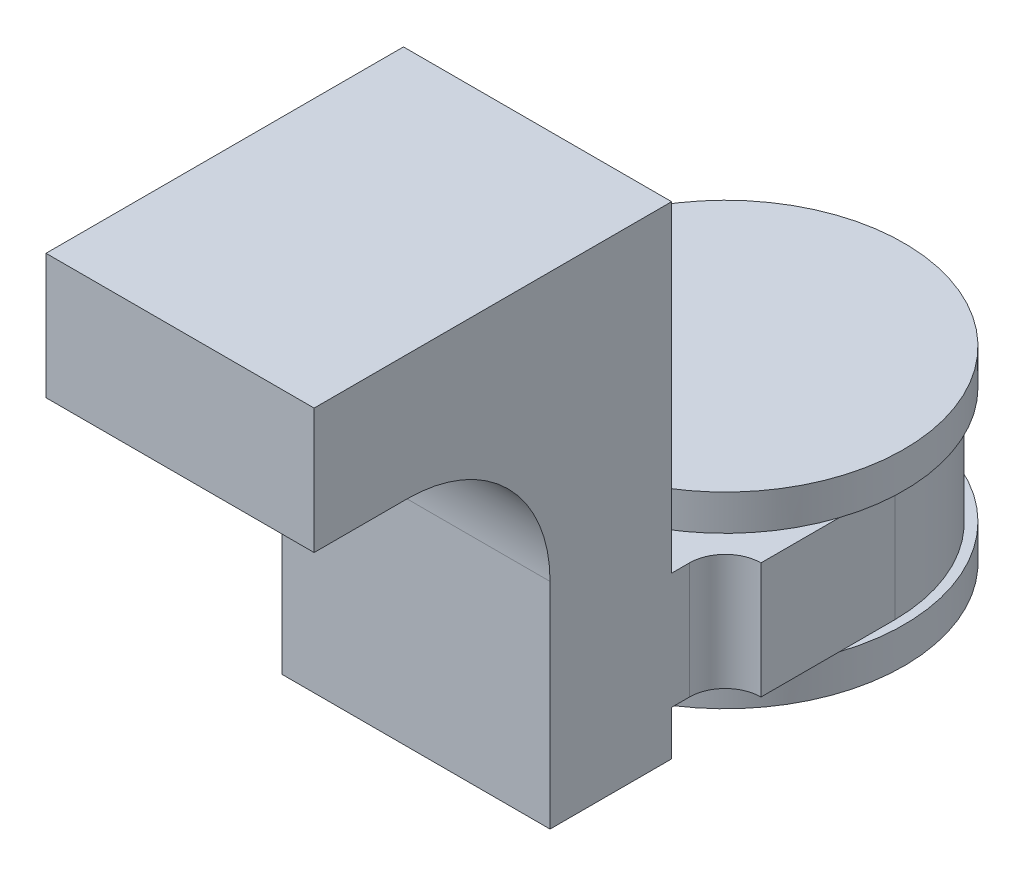
ISO-10303-21;
HEADER;
FILE_DESCRIPTION(('STEP AP214'),'2;1');
FILE_NAME('part.step','',(''),(''),'','','');
FILE_SCHEMA(('AUTOMOTIVE_DESIGN { 1 0 10303 214 1 1 1 1 }'));
ENDSEC;
DATA;
#1=APPLICATION_CONTEXT('core data for automotive mechanical design processes');
#2=APPLICATION_PROTOCOL_DEFINITION('international standard','automotive_design',2000,#1);
#3=PRODUCT_CONTEXT('',#1,'mechanical');
#4=PRODUCT('Part','Part','',(#3));
#5=PRODUCT_RELATED_PRODUCT_CATEGORY('part','',(#4));
#6=PRODUCT_DEFINITION_FORMATION('','',#4);
#7=PRODUCT_DEFINITION_CONTEXT('part definition',#1,'design');
#8=PRODUCT_DEFINITION('design','',#6,#7);
#9=PRODUCT_DEFINITION_SHAPE('','',#8);
#10=(LENGTH_UNIT() NAMED_UNIT(*) SI_UNIT(.MILLI.,.METRE.));
#11=(NAMED_UNIT(*) PLANE_ANGLE_UNIT() SI_UNIT($,.RADIAN.));
#12=(NAMED_UNIT(*) SI_UNIT($,.STERADIAN.) SOLID_ANGLE_UNIT());
#13=UNCERTAINTY_MEASURE_WITH_UNIT(LENGTH_MEASURE(1.E-05),#10,'distance_accuracy_value','');
#14=(GEOMETRIC_REPRESENTATION_CONTEXT(3) GLOBAL_UNCERTAINTY_ASSIGNED_CONTEXT((#13)) GLOBAL_UNIT_ASSIGNED_CONTEXT((#10,
#11,#12)) REPRESENTATION_CONTEXT('',''));
#15=CARTESIAN_POINT('',(0.,0.,0.));
#16=DIRECTION('',(0.,0.,1.));
#17=DIRECTION('',(1.,0.,0.));
#18=AXIS2_PLACEMENT_3D('',#15,#16,#17);
#19=CARTESIAN_POINT('',(7.5,0.,0.));
#20=DIRECTION('',(-1.,0.,0.));
#21=DIRECTION('',(0.,0.,1.));
#22=AXIS2_PLACEMENT_3D('',#19,#20,#21);
#23=PLANE('',#22);
#24=DIRECTION('',(0.,1.,0.));
#25=VECTOR('',#24,1.);
#26=CARTESIAN_POINT('',(7.5,24.5,30.5));
#27=LINE('',#26,#25);
#28=CARTESIAN_POINT('',(7.5,17.5,30.5));
#29=VERTEX_POINT('',#28);
#30=CARTESIAN_POINT('',(7.5,24.5,30.5));
#31=VERTEX_POINT('',#30);
#32=EDGE_CURVE('E156',#29,#31,#27,.T.);
#33=ORIENTED_EDGE('',*,*,#32,.F.);
#34=DIRECTION('',(0.,0.,-1.));
#35=VECTOR('',#34,1.);
#36=CARTESIAN_POINT('',(7.5,17.5,33.5));
#37=LINE('',#36,#35);
#38=CARTESIAN_POINT('',(7.5,17.5,25.3));
#39=VERTEX_POINT('',#38);
#40=EDGE_CURVE('E163',#29,#39,#37,.T.);
#41=ORIENTED_EDGE('',*,*,#40,.T.);
#42=CARTESIAN_POINT('',(7.5,9.5,25.3));
#43=DIRECTION('',(-1.,0.,0.));
#44=DIRECTION('',(0.,0.,1.));
#45=AXIS2_PLACEMENT_3D('',#42,#43,#44);
#46=CIRCLE('',#45,8.);
#47=CARTESIAN_POINT('',(7.5,9.5,17.3));
#48=VERTEX_POINT('',#47);
#49=EDGE_CURVE('E11',#39,#48,#46,.T.);
#50=ORIENTED_EDGE('',*,*,#49,.T.);
#51=DIRECTION('',(0.,1.,0.));
#52=VECTOR('',#51,1.);
#53=CARTESIAN_POINT('',(7.5,17.5,17.3));
#54=LINE('',#53,#52);
#55=CARTESIAN_POINT('',(7.5,-2.5,17.3));
#56=VERTEX_POINT('',#55);
#57=EDGE_CURVE('E282',#56,#48,#54,.T.);
#58=ORIENTED_EDGE('',*,*,#57,.F.);
#59=DIRECTION('',(0.,0.,-1.));
#60=VECTOR('',#59,1.);
#61=CARTESIAN_POINT('',(7.5,-2.5,20.3));
#62=LINE('',#61,#60);
#63=CARTESIAN_POINT('',(7.5,-2.5,10.5));
#64=VERTEX_POINT('',#63);
#65=EDGE_CURVE('E173',#56,#64,#62,.T.);
#66=ORIENTED_EDGE('',*,*,#65,.T.);
#67=DIRECTION('',(0.,-1.,0.));
#68=VECTOR('',#67,1.);
#69=CARTESIAN_POINT('',(7.5,0.,10.5));
#70=LINE('',#69,#68);
#71=CARTESIAN_POINT('',(7.5,0.,10.5));
#72=VERTEX_POINT('',#71);
#73=EDGE_CURVE('E293',#72,#64,#70,.T.);
#74=ORIENTED_EDGE('',*,*,#73,.F.);
#75=DIRECTION('',(0.,0.,-1.));
#76=VECTOR('',#75,1.);
#77=CARTESIAN_POINT('',(7.5,0.,7.5));
#78=LINE('',#77,#76);
#79=CARTESIAN_POINT('',(7.5,0.,9.5));
#80=VERTEX_POINT('',#79);
#81=EDGE_CURVE('E196',#72,#80,#78,.T.);
#82=ORIENTED_EDGE('',*,*,#81,.T.);
#83=DIRECTION('',(0.,1.,0.));
#84=VECTOR('',#83,1.);
#85=CARTESIAN_POINT('',(7.5,6.5,9.5));
#86=LINE('',#85,#84);
#87=CARTESIAN_POINT('',(7.5,6.5,9.5));
#88=VERTEX_POINT('',#87);
#89=EDGE_CURVE('E257',#80,#88,#86,.T.);
#90=ORIENTED_EDGE('',*,*,#89,.T.);
#91=DIRECTION('',(0.,0.,1.));
#92=VECTOR('',#91,1.);
#93=CARTESIAN_POINT('',(7.5,6.5,7.5));
#94=LINE('',#93,#92);
#95=CARTESIAN_POINT('',(7.5,6.5,10.5));
#96=VERTEX_POINT('',#95);
#97=EDGE_CURVE('E190',#88,#96,#94,.T.);
#98=ORIENTED_EDGE('',*,*,#97,.T.);
#99=DIRECTION('',(0.,-1.,0.));
#100=VECTOR('',#99,1.);
#101=CARTESIAN_POINT('',(7.5,24.5,10.5));
#102=LINE('',#101,#100);
#103=CARTESIAN_POINT('',(7.5,24.5,10.5));
#104=VERTEX_POINT('',#103);
#105=EDGE_CURVE('E303',#104,#96,#102,.T.);
#106=ORIENTED_EDGE('',*,*,#105,.F.);
#107=DIRECTION('',(0.,0.,-1.));
#108=VECTOR('',#107,1.);
#109=CARTESIAN_POINT('',(7.5,24.5,49.0271648444464));
#110=LINE('',#109,#108);
#111=EDGE_CURVE('E166',#31,#104,#110,.T.);
#112=ORIENTED_EDGE('',*,*,#111,.F.);
#113=EDGE_LOOP('',(#33,#41,#50,#58,#66,#74,#82,#90,#98,#106,#112));
#114=FACE_BOUND('',#113,.T.);
#115=ADVANCED_FACE('F35',(#114),#23,.F.);
#116=CARTESIAN_POINT('',(-7.5,0.,0.));
#117=DIRECTION('',(-1.,0.,0.));
#118=DIRECTION('',(0.,0.,1.));
#119=AXIS2_PLACEMENT_3D('',#116,#117,#118);
#120=PLANE('',#119);
#121=DIRECTION('',(0.,0.,-1.));
#122=VECTOR('',#121,1.);
#123=CARTESIAN_POINT('',(-7.5,17.5,33.5));
#124=LINE('',#123,#122);
#125=CARTESIAN_POINT('',(-7.5,17.5,30.5));
#126=VERTEX_POINT('',#125);
#127=CARTESIAN_POINT('',(-7.5,17.5,25.3));
#128=VERTEX_POINT('',#127);
#129=EDGE_CURVE('E170',#126,#128,#124,.T.);
#130=ORIENTED_EDGE('',*,*,#129,.F.);
#131=DIRECTION('',(0.,-1.,0.));
#132=VECTOR('',#131,1.);
#133=CARTESIAN_POINT('',(-7.5,24.5,30.5));
#134=LINE('',#133,#132);
#135=CARTESIAN_POINT('',(-7.5,24.5,30.5));
#136=VERTEX_POINT('',#135);
#137=EDGE_CURVE('E159',#136,#126,#134,.T.);
#138=ORIENTED_EDGE('',*,*,#137,.F.);
#139=DIRECTION('',(0.,0.,-1.));
#140=VECTOR('',#139,1.);
#141=CARTESIAN_POINT('',(-7.5,24.5,49.0271648444464));
#142=LINE('',#141,#140);
#143=CARTESIAN_POINT('',(-7.5,24.5,10.5));
#144=VERTEX_POINT('',#143);
#145=EDGE_CURVE('E199',#136,#144,#142,.T.);
#146=ORIENTED_EDGE('',*,*,#145,.T.);
#147=DIRECTION('',(0.,1.,0.));
#148=VECTOR('',#147,1.);
#149=CARTESIAN_POINT('',(-7.5,24.5,10.5));
#150=LINE('',#149,#148);
#151=CARTESIAN_POINT('',(-7.5,6.5,10.5));
#152=VERTEX_POINT('',#151);
#153=EDGE_CURVE('E176',#152,#144,#150,.T.);
#154=ORIENTED_EDGE('',*,*,#153,.F.);
#155=DIRECTION('',(0.,0.,-1.));
#156=VECTOR('',#155,1.);
#157=CARTESIAN_POINT('',(-7.5,6.5,7.5));
#158=LINE('',#157,#156);
#159=CARTESIAN_POINT('',(-7.5,6.5,9.5));
#160=VERTEX_POINT('',#159);
#161=EDGE_CURVE('E189',#152,#160,#158,.T.);
#162=ORIENTED_EDGE('',*,*,#161,.T.);
#163=DIRECTION('',(0.,-1.,0.));
#164=VECTOR('',#163,1.);
#165=CARTESIAN_POINT('',(-7.5,0.,9.5));
#166=LINE('',#165,#164);
#167=CARTESIAN_POINT('',(-7.5,0.,9.5));
#168=VERTEX_POINT('',#167);
#169=EDGE_CURVE('E260',#160,#168,#166,.T.);
#170=ORIENTED_EDGE('',*,*,#169,.T.);
#171=DIRECTION('',(0.,0.,1.));
#172=VECTOR('',#171,1.);
#173=CARTESIAN_POINT('',(-7.5,0.,7.5));
#174=LINE('',#173,#172);
#175=CARTESIAN_POINT('',(-7.5,0.,10.5));
#176=VERTEX_POINT('',#175);
#177=EDGE_CURVE('E191',#168,#176,#174,.T.);
#178=ORIENTED_EDGE('',*,*,#177,.T.);
#179=DIRECTION('',(0.,1.,0.));
#180=VECTOR('',#179,1.);
#181=CARTESIAN_POINT('',(-7.5,0.,10.5));
#182=LINE('',#181,#180);
#183=CARTESIAN_POINT('',(-7.5,-2.5,10.5));
#184=VERTEX_POINT('',#183);
#185=EDGE_CURVE('E299',#184,#176,#182,.T.);
#186=ORIENTED_EDGE('',*,*,#185,.F.);
#187=DIRECTION('',(0.,0.,-1.));
#188=VECTOR('',#187,1.);
#189=CARTESIAN_POINT('',(-7.5,-2.5,20.3));
#190=LINE('',#189,#188);
#191=CARTESIAN_POINT('',(-7.5,-2.5,17.3));
#192=VERTEX_POINT('',#191);
#193=EDGE_CURVE('E286',#192,#184,#190,.T.);
#194=ORIENTED_EDGE('',*,*,#193,.F.);
#195=DIRECTION('',(0.,-1.,0.));
#196=VECTOR('',#195,1.);
#197=CARTESIAN_POINT('',(-7.5,17.5,17.3));
#198=LINE('',#197,#196);
#199=CARTESIAN_POINT('',(-7.5,9.5,17.3));
#200=VERTEX_POINT('',#199);
#201=EDGE_CURVE('E279',#200,#192,#198,.T.);
#202=ORIENTED_EDGE('',*,*,#201,.F.);
#203=CARTESIAN_POINT('',(-7.5,9.5,25.3));
#204=DIRECTION('',(-1.,0.,0.));
#205=DIRECTION('',(0.,0.,1.));
#206=AXIS2_PLACEMENT_3D('',#203,#204,#205);
#207=CIRCLE('',#206,8.);
#208=EDGE_CURVE('E43',#200,#128,#207,.F.);
#209=ORIENTED_EDGE('',*,*,#208,.T.);
#210=EDGE_LOOP('',(#130,#138,#146,#154,#162,#170,#178,#186,#194,#202,#209));
#211=FACE_BOUND('',#210,.T.);
#212=ADVANCED_FACE('F285',(#211),#120,.T.);
#213=CARTESIAN_POINT('',(0.,24.5,49.0271648444464));
#214=DIRECTION('',(0.,1.,0.));
#215=DIRECTION('',(0.,0.,1.));
#216=AXIS2_PLACEMENT_3D('',#213,#214,#215);
#217=PLANE('',#216);
#218=ORIENTED_EDGE('',*,*,#145,.F.);
#219=DIRECTION('',(-1.,0.,0.));
#220=VECTOR('',#219,1.);
#221=CARTESIAN_POINT('',(-7.5,24.5,30.5));
#222=LINE('',#221,#220);
#223=EDGE_CURVE('E167',#31,#136,#222,.T.);
#224=ORIENTED_EDGE('',*,*,#223,.F.);
#225=ORIENTED_EDGE('',*,*,#111,.T.);
#226=DIRECTION('',(1.,0.,0.));
#227=VECTOR('',#226,1.);
#228=CARTESIAN_POINT('',(7.5,24.5,10.5));
#229=LINE('',#228,#227);
#230=EDGE_CURVE('E171',#144,#104,#229,.T.);
#231=ORIENTED_EDGE('',*,*,#230,.F.);
#232=EDGE_LOOP('',(#218,#224,#225,#231));
#233=FACE_BOUND('',#232,.T.);
#234=ADVANCED_FACE('F315',(#233),#217,.T.);
#235=CARTESIAN_POINT('',(-7.5,17.5,33.5));
#236=DIRECTION('',(0.,1.,0.));
#237=DIRECTION('',(0.,0.,1.));
#238=AXIS2_PLACEMENT_3D('',#235,#236,#237);
#239=PLANE('',#238);
#240=ORIENTED_EDGE('',*,*,#129,.T.);
#241=DIRECTION('',(-1.,0.,0.));
#242=VECTOR('',#241,1.);
#243=CARTESIAN_POINT('',(-7.5,17.5,25.3));
#244=LINE('',#243,#242);
#245=EDGE_CURVE('E50',#128,#39,#244,.F.);
#246=ORIENTED_EDGE('',*,*,#245,.T.);
#247=ORIENTED_EDGE('',*,*,#40,.F.);
#248=DIRECTION('',(1.,0.,0.));
#249=VECTOR('',#248,1.);
#250=CARTESIAN_POINT('',(-7.5,17.5,30.5));
#251=LINE('',#250,#249);
#252=EDGE_CURVE('E153',#126,#29,#251,.T.);
#253=ORIENTED_EDGE('',*,*,#252,.F.);
#254=EDGE_LOOP('',(#240,#246,#247,#253));
#255=FACE_BOUND('',#254,.T.);
#256=ADVANCED_FACE('F169',(#255),#239,.F.);
#257=CARTESIAN_POINT('',(-7.5,-2.5,20.3));
#258=DIRECTION('',(0.,1.,0.));
#259=DIRECTION('',(0.,0.,1.));
#260=AXIS2_PLACEMENT_3D('',#257,#258,#259);
#261=PLANE('',#260);
#262=DIRECTION('',(1.,0.,0.));
#263=VECTOR('',#262,1.);
#264=CARTESIAN_POINT('',(-7.5,-2.5,17.3));
#265=LINE('',#264,#263);
#266=EDGE_CURVE('E287',#192,#56,#265,.T.);
#267=ORIENTED_EDGE('',*,*,#266,.F.);
#268=ORIENTED_EDGE('',*,*,#193,.T.);
#269=DIRECTION('',(-1.,0.,0.));
#270=VECTOR('',#269,1.);
#271=CARTESIAN_POINT('',(7.5,-2.5,10.5));
#272=LINE('',#271,#270);
#273=EDGE_CURVE('E296',#64,#184,#272,.T.);
#274=ORIENTED_EDGE('',*,*,#273,.F.);
#275=ORIENTED_EDGE('',*,*,#65,.F.);
#276=EDGE_LOOP('',(#267,#268,#274,#275));
#277=FACE_BOUND('',#276,.T.);
#278=ADVANCED_FACE('F327',(#277),#261,.F.);
#279=CARTESIAN_POINT('',(0.,0.,0.0612691628307606));
#280=DIRECTION('',(0.,-1.,0.));
#281=DIRECTION('',(0.,0.,-1.));
#282=AXIS2_PLACEMENT_3D('',#279,#280,#281);
#283=PLANE('',#282);
#284=DIRECTION('',(1.,0.,0.));
#285=VECTOR('',#284,1.);
#286=CARTESIAN_POINT('',(7.5,0.,10.5));
#287=LINE('',#286,#285);
#288=EDGE_CURVE('E301',#176,#72,#287,.T.);
#289=ORIENTED_EDGE('',*,*,#288,.F.);
#290=ORIENTED_EDGE('',*,*,#177,.F.);
#291=CARTESIAN_POINT('',(-9.5,0.,9.5));
#292=DIRECTION('',(0.,-1.,0.));
#293=DIRECTION('',(0.,0.,-1.));
#294=AXIS2_PLACEMENT_3D('',#291,#292,#293);
#295=CIRCLE('',#294,2.);
#296=CARTESIAN_POINT('',(-9.5,0.,7.5));
#297=VERTEX_POINT('',#296);
#298=EDGE_CURVE('E267',#168,#297,#295,.F.);
#299=ORIENTED_EDGE('',*,*,#298,.T.);
#300=DIRECTION('',(0.,0.,1.));
#301=VECTOR('',#300,1.);
#302=CARTESIAN_POINT('',(-9.5,0.,0.));
#303=LINE('',#302,#301);
#304=CARTESIAN_POINT('',(-9.5,0.,3.1224989991992));
#305=VERTEX_POINT('',#304);
#306=EDGE_CURVE('E242',#305,#297,#303,.T.);
#307=ORIENTED_EDGE('',*,*,#306,.F.);
#308=CARTESIAN_POINT('',(0.,0.,0.));
#309=DIRECTION('',(0.,-1.,0.));
#310=DIRECTION('',(0.,0.,-1.));
#311=AXIS2_PLACEMENT_3D('',#308,#309,#310);
#312=CIRCLE('',#311,10.);
#313=CARTESIAN_POINT('',(9.5,0.,3.1224989991992));
#314=VERTEX_POINT('',#313);
#315=EDGE_CURVE('E218',#314,#305,#312,.T.);
#316=ORIENTED_EDGE('',*,*,#315,.F.);
#317=DIRECTION('',(0.,0.,-1.));
#318=VECTOR('',#317,1.);
#319=CARTESIAN_POINT('',(9.5,0.,0.));
#320=LINE('',#319,#318);
#321=CARTESIAN_POINT('',(9.5,0.,7.5));
#322=VERTEX_POINT('',#321);
#323=EDGE_CURVE('E232',#322,#314,#320,.T.);
#324=ORIENTED_EDGE('',*,*,#323,.F.);
#325=CARTESIAN_POINT('',(9.5,0.,9.5));
#326=DIRECTION('',(0.,-1.,0.));
#327=DIRECTION('',(0.,0.,-1.));
#328=AXIS2_PLACEMENT_3D('',#325,#326,#327);
#329=CIRCLE('',#328,2.);
#330=EDGE_CURVE('E264',#322,#80,#329,.F.);
#331=ORIENTED_EDGE('',*,*,#330,.T.);
#332=ORIENTED_EDGE('',*,*,#81,.F.);
#333=EDGE_LOOP('',(#289,#290,#299,#307,#316,#324,#331,#332));
#334=FACE_BOUND('',#333,.T.);
#335=ADVANCED_FACE('F333',(#334),#283,.T.);
#336=CARTESIAN_POINT('',(0.,6.5,0.0612691628307606));
#337=DIRECTION('',(0.,-1.,0.));
#338=DIRECTION('',(0.,0.,-1.));
#339=AXIS2_PLACEMENT_3D('',#336,#337,#338);
#340=CYLINDRICAL_SURFACE('',#339,9.50019757217259);
#341=CARTESIAN_POINT('',(0.,0.,0.0612691628307606));
#342=DIRECTION('',(0.,1.,0.));
#343=DIRECTION('',(0.,0.,-1.));
#344=AXIS2_PLACEMENT_3D('',#341,#342,#343);
#345=CIRCLE('',#344,9.50019757217259);
#346=CARTESIAN_POINT('',(9.5,0.,0.));
#347=VERTEX_POINT('',#346);
#348=CARTESIAN_POINT('',(-9.5,0.,0.));
#349=VERTEX_POINT('',#348);
#350=EDGE_CURVE('E224',#347,#349,#345,.T.);
#351=ORIENTED_EDGE('',*,*,#350,.T.);
#352=DIRECTION('',(0.,-1.,0.));
#353=VECTOR('',#352,1.);
#354=CARTESIAN_POINT('',(-9.5,6.5,0.));
#355=LINE('',#354,#353);
#356=CARTESIAN_POINT('',(-9.5,6.5,0.));
#357=VERTEX_POINT('',#356);
#358=EDGE_CURVE('E255',#357,#349,#355,.T.);
#359=ORIENTED_EDGE('',*,*,#358,.F.);
#360=CARTESIAN_POINT('',(0.,6.5,0.0612691628307606));
#361=DIRECTION('',(0.,1.,0.));
#362=DIRECTION('',(0.,0.,-1.));
#363=AXIS2_PLACEMENT_3D('',#360,#361,#362);
#364=CIRCLE('',#363,9.50019757217259);
#365=CARTESIAN_POINT('',(9.5,6.5,0.));
#366=VERTEX_POINT('',#365);
#367=EDGE_CURVE('E228',#366,#357,#364,.T.);
#368=ORIENTED_EDGE('',*,*,#367,.F.);
#369=DIRECTION('',(0.,-1.,0.));
#370=VECTOR('',#369,1.);
#371=CARTESIAN_POINT('',(9.5,6.5,0.));
#372=LINE('',#371,#370);
#373=EDGE_CURVE('E239',#366,#347,#372,.T.);
#374=ORIENTED_EDGE('',*,*,#373,.T.);
#375=EDGE_LOOP('',(#351,#359,#368,#374));
#376=FACE_BOUND('',#375,.T.);
#377=ADVANCED_FACE('F407',(#376),#340,.T.);
#378=CARTESIAN_POINT('',(-9.5,6.5,0.));
#379=DIRECTION('',(1.,0.,0.));
#380=DIRECTION('',(0.,0.,-1.));
#381=AXIS2_PLACEMENT_3D('',#378,#379,#380);
#382=PLANE('',#381);
#383=EDGE_CURVE('E243',#349,#305,#303,.T.);
#384=ORIENTED_EDGE('',*,*,#383,.T.);
#385=ORIENTED_EDGE('',*,*,#306,.T.);
#386=DIRECTION('',(0.,-1.,0.));
#387=VECTOR('',#386,1.);
#388=CARTESIAN_POINT('',(-9.5,6.5,7.5));
#389=LINE('',#388,#387);
#390=CARTESIAN_POINT('',(-9.5,6.5,7.5));
#391=VERTEX_POINT('',#390);
#392=EDGE_CURVE('E252',#391,#297,#389,.T.);
#393=ORIENTED_EDGE('',*,*,#392,.F.);
#394=DIRECTION('',(0.,0.,1.));
#395=VECTOR('',#394,1.);
#396=CARTESIAN_POINT('',(-9.5,6.5,0.));
#397=LINE('',#396,#395);
#398=CARTESIAN_POINT('',(-9.5,6.5,3.1224989991992));
#399=VERTEX_POINT('',#398);
#400=EDGE_CURVE('E231',#399,#391,#397,.T.);
#401=ORIENTED_EDGE('',*,*,#400,.F.);
#402=EDGE_CURVE('E233',#357,#399,#397,.T.);
#403=ORIENTED_EDGE('',*,*,#402,.F.);
#404=ORIENTED_EDGE('',*,*,#358,.T.);
#405=EDGE_LOOP('',(#384,#385,#393,#401,#403,#404));
#406=FACE_BOUND('',#405,.T.);
#407=ADVANCED_FACE('F350',(#406),#382,.F.);
#408=CARTESIAN_POINT('',(9.5,6.5,0.));
#409=DIRECTION('',(-1.,0.,0.));
#410=DIRECTION('',(0.,0.,1.));
#411=AXIS2_PLACEMENT_3D('',#408,#409,#410);
#412=PLANE('',#411);
#413=ORIENTED_EDGE('',*,*,#323,.T.);
#414=EDGE_CURVE('E245',#314,#347,#320,.T.);
#415=ORIENTED_EDGE('',*,*,#414,.T.);
#416=ORIENTED_EDGE('',*,*,#373,.F.);
#417=DIRECTION('',(0.,0.,-1.));
#418=VECTOR('',#417,1.);
#419=CARTESIAN_POINT('',(9.5,6.5,0.));
#420=LINE('',#419,#418);
#421=CARTESIAN_POINT('',(9.5,6.5,3.1224989991992));
#422=VERTEX_POINT('',#421);
#423=EDGE_CURVE('E236',#422,#366,#420,.T.);
#424=ORIENTED_EDGE('',*,*,#423,.F.);
#425=CARTESIAN_POINT('',(9.5,6.5,7.5));
#426=VERTEX_POINT('',#425);
#427=EDGE_CURVE('E237',#426,#422,#420,.T.);
#428=ORIENTED_EDGE('',*,*,#427,.F.);
#429=DIRECTION('',(0.,-1.,0.));
#430=VECTOR('',#429,1.);
#431=CARTESIAN_POINT('',(9.5,6.5,7.5));
#432=LINE('',#431,#430);
#433=EDGE_CURVE('E250',#426,#322,#432,.T.);
#434=ORIENTED_EDGE('',*,*,#433,.T.);
#435=EDGE_LOOP('',(#413,#415,#416,#424,#428,#434));
#436=FACE_BOUND('',#435,.T.);
#437=ADVANCED_FACE('F340',(#436),#412,.F.);
#438=CARTESIAN_POINT('',(0.,6.5,0.0612691628307606));
#439=DIRECTION('',(0.,-1.,0.));
#440=DIRECTION('',(0.,0.,-1.));
#441=AXIS2_PLACEMENT_3D('',#438,#439,#440);
#442=PLANE('',#441);
#443=ORIENTED_EDGE('',*,*,#161,.F.);
#444=DIRECTION('',(-1.,0.,0.));
#445=VECTOR('',#444,1.);
#446=CARTESIAN_POINT('',(7.5,6.5,10.5));
#447=LINE('',#446,#445);
#448=EDGE_CURVE('E306',#96,#152,#447,.T.);
#449=ORIENTED_EDGE('',*,*,#448,.F.);
#450=ORIENTED_EDGE('',*,*,#97,.F.);
#451=CARTESIAN_POINT('',(9.5,6.5,9.5));
#452=DIRECTION('',(0.,-1.,0.));
#453=DIRECTION('',(0.,0.,-1.));
#454=AXIS2_PLACEMENT_3D('',#451,#452,#453);
#455=CIRCLE('',#454,2.);
#456=EDGE_CURVE('E262',#88,#426,#455,.T.);
#457=ORIENTED_EDGE('',*,*,#456,.T.);
#458=ORIENTED_EDGE('',*,*,#427,.T.);
#459=CARTESIAN_POINT('',(0.,6.5,0.));
#460=DIRECTION('',(0.,1.,0.));
#461=DIRECTION('',(0.,0.,1.));
#462=AXIS2_PLACEMENT_3D('',#459,#460,#461);
#463=CIRCLE('',#462,10.);
#464=EDGE_CURVE('E227',#399,#422,#463,.T.);
#465=ORIENTED_EDGE('',*,*,#464,.F.);
#466=ORIENTED_EDGE('',*,*,#400,.T.);
#467=CARTESIAN_POINT('',(-9.5,6.5,9.5));
#468=DIRECTION('',(0.,-1.,0.));
#469=DIRECTION('',(0.,0.,-1.));
#470=AXIS2_PLACEMENT_3D('',#467,#468,#469);
#471=CIRCLE('',#470,2.);
#472=EDGE_CURVE('E269',#391,#160,#471,.T.);
#473=ORIENTED_EDGE('',*,*,#472,.T.);
#474=EDGE_LOOP('',(#443,#449,#450,#457,#458,#465,#466,#473));
#475=FACE_BOUND('',#474,.T.);
#476=ADVANCED_FACE('F320',(#475),#442,.F.);
#477=CARTESIAN_POINT('',(0.,6.5,0.));
#478=DIRECTION('',(0.,1.,0.));
#479=DIRECTION('',(0.,0.,1.));
#480=AXIS2_PLACEMENT_3D('',#477,#478,#479);
#481=PLANE('',#480);
#482=ORIENTED_EDGE('',*,*,#367,.T.);
#483=ORIENTED_EDGE('',*,*,#402,.T.);
#484=EDGE_CURVE('E217',#422,#399,#463,.T.);
#485=ORIENTED_EDGE('',*,*,#484,.F.);
#486=ORIENTED_EDGE('',*,*,#423,.T.);
#487=EDGE_LOOP('',(#482,#483,#485,#486));
#488=FACE_BOUND('',#487,.T.);
#489=ADVANCED_FACE('F354',(#488),#481,.F.);
#490=CARTESIAN_POINT('',(0.,8.5,0.));
#491=DIRECTION('',(0.,-1.,0.));
#492=DIRECTION('',(0.,0.,-1.));
#493=AXIS2_PLACEMENT_3D('',#490,#491,#492);
#494=CYLINDRICAL_SURFACE('',#493,10.);
#495=CARTESIAN_POINT('',(0.,8.5,0.));
#496=DIRECTION('',(0.,1.,0.));
#497=DIRECTION('',(0.,0.,1.));
#498=AXIS2_PLACEMENT_3D('',#495,#496,#497);
#499=CIRCLE('',#498,10.);
#500=CARTESIAN_POINT('',(0.,8.5,10.));
#501=VERTEX_POINT('',#500);
#502=EDGE_CURVE('E221',#501,#501,#499,.T.);
#503=ORIENTED_EDGE('',*,*,#502,.F.);
#504=EDGE_LOOP('',(#503));
#505=FACE_BOUND('',#504,.T.);
#506=ORIENTED_EDGE('',*,*,#484,.T.);
#507=ORIENTED_EDGE('',*,*,#464,.T.);
#508=EDGE_LOOP('',(#506,#507));
#509=FACE_BOUND('',#508,.T.);
#510=ADVANCED_FACE('F356',(#505,#509),#494,.T.);
#511=CARTESIAN_POINT('',(0.,8.5,0.));
#512=DIRECTION('',(0.,1.,0.));
#513=DIRECTION('',(0.,0.,1.));
#514=AXIS2_PLACEMENT_3D('',#511,#512,#513);
#515=PLANE('',#514);
#516=ORIENTED_EDGE('',*,*,#502,.T.);
#517=EDGE_LOOP('',(#516));
#518=FACE_BOUND('',#517,.T.);
#519=ADVANCED_FACE('F358',(#518),#515,.T.);
#520=CARTESIAN_POINT('',(0.,-2.,0.));
#521=DIRECTION('',(0.,1.,0.));
#522=DIRECTION('',(0.,0.,1.));
#523=AXIS2_PLACEMENT_3D('',#520,#521,#522);
#524=CYLINDRICAL_SURFACE('',#523,10.);
#525=CARTESIAN_POINT('',(0.,-2.,0.));
#526=DIRECTION('',(0.,-1.,0.));
#527=DIRECTION('',(0.,0.,-1.));
#528=AXIS2_PLACEMENT_3D('',#525,#526,#527);
#529=CIRCLE('',#528,10.);
#530=CARTESIAN_POINT('',(0.,-2.,-10.));
#531=VERTEX_POINT('',#530);
#532=EDGE_CURVE('E214',#531,#531,#529,.T.);
#533=ORIENTED_EDGE('',*,*,#532,.F.);
#534=EDGE_LOOP('',(#533));
#535=FACE_BOUND('',#534,.T.);
#536=ORIENTED_EDGE('',*,*,#315,.T.);
#537=EDGE_CURVE('E211',#305,#314,#312,.T.);
#538=ORIENTED_EDGE('',*,*,#537,.T.);
#539=EDGE_LOOP('',(#536,#538));
#540=FACE_BOUND('',#539,.T.);
#541=ADVANCED_FACE('F365',(#535,#540),#524,.T.);
#542=CARTESIAN_POINT('',(0.,-2.,0.));
#543=DIRECTION('',(0.,-1.,0.));
#544=DIRECTION('',(0.,0.,-1.));
#545=AXIS2_PLACEMENT_3D('',#542,#543,#544);
#546=PLANE('',#545);
#547=CARTESIAN_POINT('',(0.,-2.,0.));
#548=DIRECTION('',(0.,-1.,0.));
#549=DIRECTION('',(0.,0.,-1.));
#550=AXIS2_PLACEMENT_3D('',#547,#548,#549);
#551=CIRCLE('',#550,5.);
#552=CARTESIAN_POINT('',(0.,-2.,-5.));
#553=VERTEX_POINT('',#552);
#554=EDGE_CURVE('E207',#553,#553,#551,.T.);
#555=ORIENTED_EDGE('',*,*,#554,.F.);
#556=EDGE_LOOP('',(#555));
#557=FACE_BOUND('',#556,.T.);
#558=ORIENTED_EDGE('',*,*,#532,.T.);
#559=EDGE_LOOP('',(#558));
#560=FACE_BOUND('',#559,.T.);
#561=ADVANCED_FACE('F388',(#557,#560),#546,.T.);
#562=CARTESIAN_POINT('',(0.,0.,0.));
#563=DIRECTION('',(0.,-1.,0.));
#564=DIRECTION('',(0.,0.,-1.));
#565=AXIS2_PLACEMENT_3D('',#562,#563,#564);
#566=PLANE('',#565);
#567=ORIENTED_EDGE('',*,*,#414,.F.);
#568=ORIENTED_EDGE('',*,*,#537,.F.);
#569=ORIENTED_EDGE('',*,*,#383,.F.);
#570=ORIENTED_EDGE('',*,*,#350,.F.);
#571=EDGE_LOOP('',(#567,#568,#569,#570));
#572=FACE_BOUND('',#571,.T.);
#573=ADVANCED_FACE('F386',(#572),#566,.F.);
#574=CARTESIAN_POINT('',(0.,-3.5,0.));
#575=DIRECTION('',(0.,1.,0.));
#576=DIRECTION('',(0.,0.,1.));
#577=AXIS2_PLACEMENT_3D('',#574,#575,#576);
#578=CYLINDRICAL_SURFACE('',#577,5.);
#579=CARTESIAN_POINT('',(0.,-3.5,0.));
#580=DIRECTION('',(0.,-1.,0.));
#581=DIRECTION('',(0.,0.,-1.));
#582=AXIS2_PLACEMENT_3D('',#579,#580,#581);
#583=CIRCLE('',#582,5.);
#584=CARTESIAN_POINT('',(0.,-3.5,-5.));
#585=VERTEX_POINT('',#584);
#586=EDGE_CURVE('E208',#585,#585,#583,.T.);
#587=ORIENTED_EDGE('',*,*,#586,.F.);
#588=EDGE_LOOP('',(#587));
#589=FACE_BOUND('',#588,.T.);
#590=ORIENTED_EDGE('',*,*,#554,.T.);
#591=EDGE_LOOP('',(#590));
#592=FACE_BOUND('',#591,.T.);
#593=ADVANCED_FACE('F382',(#589,#592),#578,.T.);
#594=CARTESIAN_POINT('',(0.,-3.5,0.));
#595=DIRECTION('',(0.,-1.,0.));
#596=DIRECTION('',(0.,0.,-1.));
#597=AXIS2_PLACEMENT_3D('',#594,#595,#596);
#598=PLANE('',#597);
#599=ORIENTED_EDGE('',*,*,#586,.T.);
#600=EDGE_LOOP('',(#599));
#601=FACE_BOUND('',#600,.T.);
#602=ADVANCED_FACE('F379',(#601),#598,.T.);
#603=CARTESIAN_POINT('',(9.5,0.,9.5));
#604=DIRECTION('',(0.,-1.,0.));
#605=DIRECTION('',(0.,0.,-1.));
#606=AXIS2_PLACEMENT_3D('',#603,#604,#605);
#607=CYLINDRICAL_SURFACE('',#606,2.);
#608=ORIENTED_EDGE('',*,*,#330,.F.);
#609=ORIENTED_EDGE('',*,*,#433,.F.);
#610=ORIENTED_EDGE('',*,*,#456,.F.);
#611=ORIENTED_EDGE('',*,*,#89,.F.);
#612=EDGE_LOOP('',(#608,#609,#610,#611));
#613=FACE_BOUND('',#612,.T.);
#614=ADVANCED_FACE('F338',(#613),#607,.F.);
#615=CARTESIAN_POINT('',(-9.5,0.,9.5));
#616=DIRECTION('',(0.,-1.,0.));
#617=DIRECTION('',(0.,0.,-1.));
#618=AXIS2_PLACEMENT_3D('',#615,#616,#617);
#619=CYLINDRICAL_SURFACE('',#618,2.);
#620=ORIENTED_EDGE('',*,*,#472,.F.);
#621=ORIENTED_EDGE('',*,*,#392,.T.);
#622=ORIENTED_EDGE('',*,*,#298,.F.);
#623=ORIENTED_EDGE('',*,*,#169,.F.);
#624=EDGE_LOOP('',(#620,#621,#622,#623));
#625=FACE_BOUND('',#624,.T.);
#626=ADVANCED_FACE('F419',(#625),#619,.F.);
#627=CARTESIAN_POINT('',(0.,0.,10.5));
#628=DIRECTION('',(0.,0.,-1.));
#629=DIRECTION('',(-1.,0.,0.));
#630=AXIS2_PLACEMENT_3D('',#627,#628,#629);
#631=PLANE('',#630);
#632=ORIENTED_EDGE('',*,*,#105,.T.);
#633=ORIENTED_EDGE('',*,*,#448,.T.);
#634=ORIENTED_EDGE('',*,*,#153,.T.);
#635=ORIENTED_EDGE('',*,*,#230,.T.);
#636=EDGE_LOOP('',(#632,#633,#634,#635));
#637=FACE_BOUND('',#636,.T.);
#638=ADVANCED_FACE('F317',(#637),#631,.T.);
#639=CARTESIAN_POINT('',(0.,0.,10.5));
#640=DIRECTION('',(0.,0.,-1.));
#641=DIRECTION('',(-1.,0.,0.));
#642=AXIS2_PLACEMENT_3D('',#639,#640,#641);
#643=PLANE('',#642);
#644=ORIENTED_EDGE('',*,*,#73,.T.);
#645=ORIENTED_EDGE('',*,*,#273,.T.);
#646=ORIENTED_EDGE('',*,*,#185,.T.);
#647=ORIENTED_EDGE('',*,*,#288,.T.);
#648=EDGE_LOOP('',(#644,#645,#646,#647));
#649=FACE_BOUND('',#648,.T.);
#650=ADVANCED_FACE('F329',(#649),#643,.T.);
#651=CARTESIAN_POINT('',(0.,0.,17.3));
#652=DIRECTION('',(0.,0.,1.));
#653=DIRECTION('',(1.,0.,0.));
#654=AXIS2_PLACEMENT_3D('',#651,#652,#653);
#655=PLANE('',#654);
#656=ORIENTED_EDGE('',*,*,#57,.T.);
#657=DIRECTION('',(-1.,0.,0.));
#658=VECTOR('',#657,1.);
#659=CARTESIAN_POINT('',(0.,9.5,17.3));
#660=LINE('',#659,#658);
#661=EDGE_CURVE('E182',#48,#200,#660,.T.);
#662=ORIENTED_EDGE('',*,*,#661,.T.);
#663=ORIENTED_EDGE('',*,*,#201,.T.);
#664=ORIENTED_EDGE('',*,*,#266,.T.);
#665=EDGE_LOOP('',(#656,#662,#663,#664));
#666=FACE_BOUND('',#665,.T.);
#667=ADVANCED_FACE('F278',(#666),#655,.T.);
#668=CARTESIAN_POINT('',(0.,0.,30.5));
#669=DIRECTION('',(0.,0.,1.));
#670=DIRECTION('',(1.,0.,0.));
#671=AXIS2_PLACEMENT_3D('',#668,#669,#670);
#672=PLANE('',#671);
#673=ORIENTED_EDGE('',*,*,#137,.T.);
#674=ORIENTED_EDGE('',*,*,#252,.T.);
#675=ORIENTED_EDGE('',*,*,#32,.T.);
#676=ORIENTED_EDGE('',*,*,#223,.T.);
#677=EDGE_LOOP('',(#673,#674,#675,#676));
#678=FACE_BOUND('',#677,.T.);
#679=ADVANCED_FACE('F155',(#678),#672,.T.);
#680=CARTESIAN_POINT('',(0.,9.5,25.3));
#681=DIRECTION('',(-1.,0.,0.));
#682=DIRECTION('',(0.,0.,1.));
#683=AXIS2_PLACEMENT_3D('',#680,#681,#682);
#684=CYLINDRICAL_SURFACE('',#683,8.);
#685=ORIENTED_EDGE('',*,*,#49,.F.);
#686=ORIENTED_EDGE('',*,*,#245,.F.);
#687=ORIENTED_EDGE('',*,*,#208,.F.);
#688=ORIENTED_EDGE('',*,*,#661,.F.);
#689=EDGE_LOOP('',(#685,#686,#687,#688));
#690=FACE_BOUND('',#689,.T.);
#691=ADVANCED_FACE('F37',(#690),#684,.F.);
#692=CLOSED_SHELL('',(#115,#212,#234,#256,#278,#335,#377,#407,#437,#476,#489,#510,#519,#541,
#561,#573,#593,#602,#614,#626,#638,#650,#667,#679,#691));
#693=MANIFOLD_SOLID_BREP('B2',#692);
#694=ADVANCED_BREP_SHAPE_REPRESENTATION('',(#18,#693),#14);
#695=SHAPE_DEFINITION_REPRESENTATION(#9,#694);
ENDSEC;
END-ISO-10303-21;
